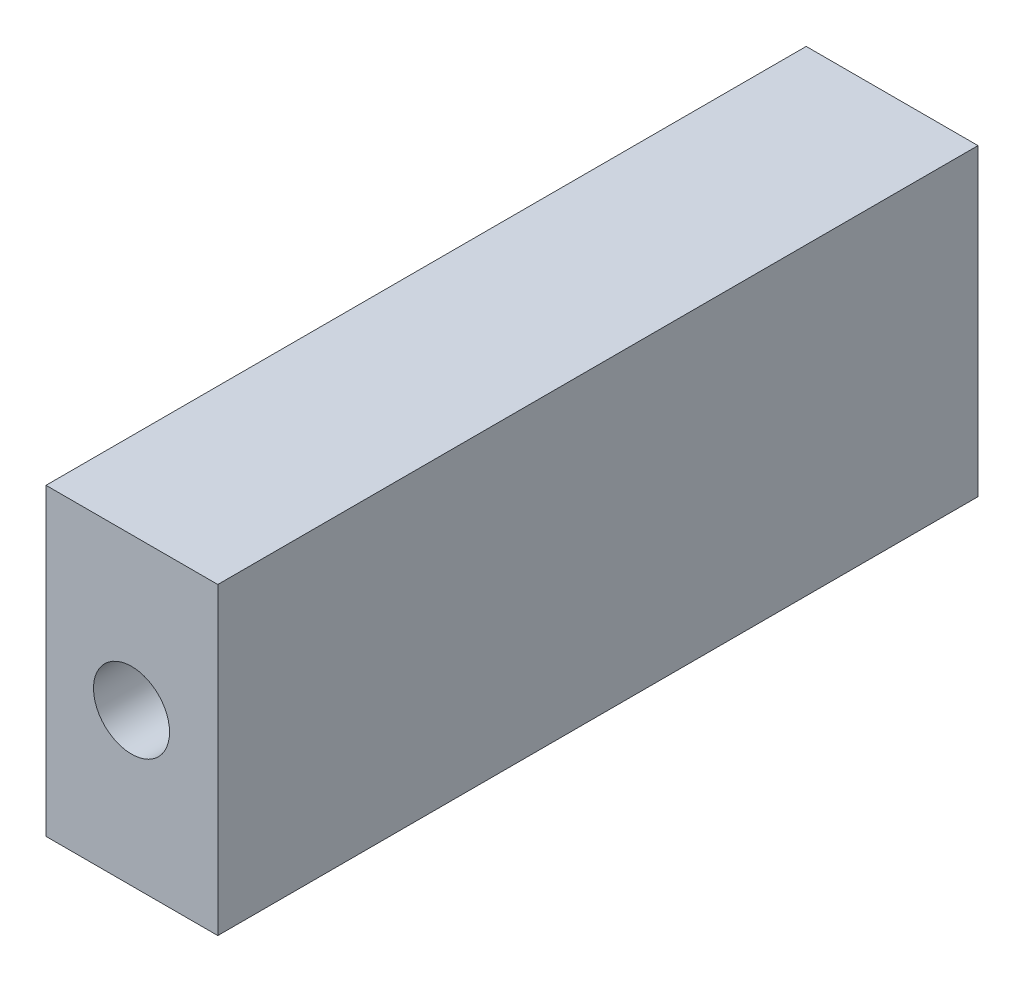
ISO-10303-21;
HEADER;
FILE_DESCRIPTION(('STEP AP214'),'2;1');
FILE_NAME('part.step','',(''),(''),'','','');
FILE_SCHEMA(('AUTOMOTIVE_DESIGN { 1 0 10303 214 1 1 1 1 }'));
ENDSEC;
DATA;
#1=APPLICATION_CONTEXT('core data for automotive mechanical design processes');
#2=APPLICATION_PROTOCOL_DEFINITION('international standard','automotive_design',2000,#1);
#3=PRODUCT_CONTEXT('',#1,'mechanical');
#4=PRODUCT('Part','Part','',(#3));
#5=PRODUCT_RELATED_PRODUCT_CATEGORY('part','',(#4));
#6=PRODUCT_DEFINITION_FORMATION('','',#4);
#7=PRODUCT_DEFINITION_CONTEXT('part definition',#1,'design');
#8=PRODUCT_DEFINITION('design','',#6,#7);
#9=PRODUCT_DEFINITION_SHAPE('','',#8);
#10=(LENGTH_UNIT() NAMED_UNIT(*) SI_UNIT(.MILLI.,.METRE.));
#11=(NAMED_UNIT(*) PLANE_ANGLE_UNIT() SI_UNIT($,.RADIAN.));
#12=(NAMED_UNIT(*) SI_UNIT($,.STERADIAN.) SOLID_ANGLE_UNIT());
#13=UNCERTAINTY_MEASURE_WITH_UNIT(LENGTH_MEASURE(1.E-05),#10,'distance_accuracy_value','');
#14=(GEOMETRIC_REPRESENTATION_CONTEXT(3) GLOBAL_UNCERTAINTY_ASSIGNED_CONTEXT((#13)) GLOBAL_UNIT_ASSIGNED_CONTEXT((#10,
#11,#12)) REPRESENTATION_CONTEXT('',''));
#15=CARTESIAN_POINT('',(0.,0.,0.));
#16=DIRECTION('',(0.,0.,1.));
#17=DIRECTION('',(1.,0.,0.));
#18=AXIS2_PLACEMENT_3D('',#15,#16,#17);
#19=CARTESIAN_POINT('',(0.,0.,10.));
#20=DIRECTION('',(1.,0.,0.));
#21=DIRECTION('',(0.,0.,-1.));
#22=AXIS2_PLACEMENT_3D('',#19,#20,#21);
#23=PLANE('',#22);
#24=DIRECTION('',(0.,-1.,0.));
#25=VECTOR('',#24,1.);
#26=CARTESIAN_POINT('',(0.,0.,0.));
#27=LINE('',#26,#25);
#28=CARTESIAN_POINT('',(0.,4.,0.));
#29=VERTEX_POINT('',#28);
#30=CARTESIAN_POINT('',(0.,0.,0.));
#31=VERTEX_POINT('',#30);
#32=EDGE_CURVE('E107',#29,#31,#27,.T.);
#33=ORIENTED_EDGE('',*,*,#32,.T.);
#34=DIRECTION('',(0.,0.,-1.));
#35=VECTOR('',#34,1.);
#36=CARTESIAN_POINT('',(0.,0.,10.));
#37=LINE('',#36,#35);
#38=CARTESIAN_POINT('',(0.,0.,10.));
#39=VERTEX_POINT('',#38);
#40=EDGE_CURVE('E11',#39,#31,#37,.T.);
#41=ORIENTED_EDGE('',*,*,#40,.F.);
#42=DIRECTION('',(0.,-1.,0.));
#43=VECTOR('',#42,1.);
#44=CARTESIAN_POINT('',(0.,0.,10.));
#45=LINE('',#44,#43);
#46=CARTESIAN_POINT('',(0.,4.,10.));
#47=VERTEX_POINT('',#46);
#48=EDGE_CURVE('E91',#47,#39,#45,.T.);
#49=ORIENTED_EDGE('',*,*,#48,.F.);
#50=DIRECTION('',(0.,0.,-1.));
#51=VECTOR('',#50,1.);
#52=CARTESIAN_POINT('',(0.,4.,10.));
#53=LINE('',#52,#51);
#54=EDGE_CURVE('E103',#47,#29,#53,.T.);
#55=ORIENTED_EDGE('',*,*,#54,.T.);
#56=EDGE_LOOP('',(#33,#41,#49,#55));
#57=FACE_BOUND('',#56,.T.);
#58=ADVANCED_FACE('F39',(#57),#23,.F.);
#59=CARTESIAN_POINT('',(0.,0.,10.));
#60=DIRECTION('',(0.,1.,0.));
#61=DIRECTION('',(0.,0.,1.));
#62=AXIS2_PLACEMENT_3D('',#59,#60,#61);
#63=PLANE('',#62);
#64=DIRECTION('',(1.,0.,0.));
#65=VECTOR('',#64,1.);
#66=CARTESIAN_POINT('',(0.,0.,0.));
#67=LINE('',#66,#65);
#68=CARTESIAN_POINT('',(2.26,0.,0.));
#69=VERTEX_POINT('',#68);
#70=EDGE_CURVE('E96',#31,#69,#67,.T.);
#71=ORIENTED_EDGE('',*,*,#70,.T.);
#72=DIRECTION('',(0.,0.,-1.));
#73=VECTOR('',#72,1.);
#74=CARTESIAN_POINT('',(2.26,0.,10.));
#75=LINE('',#74,#73);
#76=CARTESIAN_POINT('',(2.26,0.,10.));
#77=VERTEX_POINT('',#76);
#78=EDGE_CURVE('E48',#77,#69,#75,.T.);
#79=ORIENTED_EDGE('',*,*,#78,.F.);
#80=DIRECTION('',(1.,0.,0.));
#81=VECTOR('',#80,1.);
#82=CARTESIAN_POINT('',(0.,0.,10.));
#83=LINE('',#82,#81);
#84=EDGE_CURVE('E86',#39,#77,#83,.T.);
#85=ORIENTED_EDGE('',*,*,#84,.F.);
#86=ORIENTED_EDGE('',*,*,#40,.T.);
#87=EDGE_LOOP('',(#71,#79,#85,#86));
#88=FACE_BOUND('',#87,.T.);
#89=ADVANCED_FACE('F95',(#88),#63,.F.);
#90=CARTESIAN_POINT('',(2.26,0.,10.));
#91=DIRECTION('',(-1.,0.,0.));
#92=DIRECTION('',(0.,0.,1.));
#93=AXIS2_PLACEMENT_3D('',#90,#91,#92);
#94=PLANE('',#93);
#95=DIRECTION('',(0.,1.,0.));
#96=VECTOR('',#95,1.);
#97=CARTESIAN_POINT('',(2.26,0.,0.));
#98=LINE('',#97,#96);
#99=CARTESIAN_POINT('',(2.26,4.,0.));
#100=VERTEX_POINT('',#99);
#101=EDGE_CURVE('E73',#69,#100,#98,.T.);
#102=ORIENTED_EDGE('',*,*,#101,.T.);
#103=DIRECTION('',(0.,0.,-1.));
#104=VECTOR('',#103,1.);
#105=CARTESIAN_POINT('',(2.26,4.,10.));
#106=LINE('',#105,#104);
#107=CARTESIAN_POINT('',(2.26,4.,10.));
#108=VERTEX_POINT('',#107);
#109=EDGE_CURVE('E98',#108,#100,#106,.T.);
#110=ORIENTED_EDGE('',*,*,#109,.F.);
#111=DIRECTION('',(0.,1.,0.));
#112=VECTOR('',#111,1.);
#113=CARTESIAN_POINT('',(2.26,0.,10.));
#114=LINE('',#113,#112);
#115=EDGE_CURVE('E89',#77,#108,#114,.T.);
#116=ORIENTED_EDGE('',*,*,#115,.F.);
#117=ORIENTED_EDGE('',*,*,#78,.T.);
#118=EDGE_LOOP('',(#102,#110,#116,#117));
#119=FACE_BOUND('',#118,.T.);
#120=ADVANCED_FACE('F99',(#119),#94,.F.);
#121=CARTESIAN_POINT('',(0.,4.,10.));
#122=DIRECTION('',(0.,-1.,0.));
#123=DIRECTION('',(0.,0.,-1.));
#124=AXIS2_PLACEMENT_3D('',#121,#122,#123);
#125=PLANE('',#124);
#126=DIRECTION('',(-1.,0.,0.));
#127=VECTOR('',#126,1.);
#128=CARTESIAN_POINT('',(0.,4.,0.));
#129=LINE('',#128,#127);
#130=EDGE_CURVE('E79',#100,#29,#129,.T.);
#131=ORIENTED_EDGE('',*,*,#130,.T.);
#132=ORIENTED_EDGE('',*,*,#54,.F.);
#133=DIRECTION('',(-1.,0.,0.));
#134=VECTOR('',#133,1.);
#135=CARTESIAN_POINT('',(0.,4.,10.));
#136=LINE('',#135,#134);
#137=EDGE_CURVE('E56',#108,#47,#136,.T.);
#138=ORIENTED_EDGE('',*,*,#137,.F.);
#139=ORIENTED_EDGE('',*,*,#109,.T.);
#140=EDGE_LOOP('',(#131,#132,#138,#139));
#141=FACE_BOUND('',#140,.T.);
#142=ADVANCED_FACE('F121',(#141),#125,.F.);
#143=CARTESIAN_POINT('',(0.,0.,10.));
#144=DIRECTION('',(0.,0.,-1.));
#145=DIRECTION('',(-1.,0.,0.));
#146=AXIS2_PLACEMENT_3D('',#143,#144,#145);
#147=PLANE('',#146);
#148=CARTESIAN_POINT('',(1.125,2.,10.));
#149=DIRECTION('',(0.,0.,1.));
#150=DIRECTION('',(1.,0.,0.));
#151=AXIS2_PLACEMENT_3D('',#148,#149,#150);
#152=CIRCLE('',#151,0.5);
#153=CARTESIAN_POINT('',(1.625,2.,10.));
#154=VERTEX_POINT('',#153);
#155=EDGE_CURVE('E128',#154,#154,#152,.T.);
#156=ORIENTED_EDGE('',*,*,#155,.F.);
#157=EDGE_LOOP('',(#156));
#158=FACE_BOUND('',#157,.T.);
#159=ORIENTED_EDGE('',*,*,#48,.T.);
#160=ORIENTED_EDGE('',*,*,#84,.T.);
#161=ORIENTED_EDGE('',*,*,#115,.T.);
#162=ORIENTED_EDGE('',*,*,#137,.T.);
#163=EDGE_LOOP('',(#159,#160,#161,#162));
#164=FACE_BOUND('',#163,.T.);
#165=ADVANCED_FACE('F87',(#158,#164),#147,.F.);
#166=CARTESIAN_POINT('',(0.,0.,0.));
#167=DIRECTION('',(0.,0.,-1.));
#168=DIRECTION('',(-1.,0.,0.));
#169=AXIS2_PLACEMENT_3D('',#166,#167,#168);
#170=PLANE('',#169);
#171=ORIENTED_EDGE('',*,*,#32,.F.);
#172=ORIENTED_EDGE('',*,*,#130,.F.);
#173=ORIENTED_EDGE('',*,*,#101,.F.);
#174=ORIENTED_EDGE('',*,*,#70,.F.);
#175=EDGE_LOOP('',(#171,#172,#173,#174));
#176=FACE_BOUND('',#175,.T.);
#177=ADVANCED_FACE('F124',(#176),#170,.T.);
#178=CARTESIAN_POINT('',(1.125,2.,5.));
#179=DIRECTION('',(0.,0.,1.));
#180=DIRECTION('',(1.,0.,0.));
#181=AXIS2_PLACEMENT_3D('',#178,#179,#180);
#182=CYLINDRICAL_SURFACE('',#181,0.5);
#183=CARTESIAN_POINT('',(1.125,2.,5.));
#184=DIRECTION('',(0.,0.,1.));
#185=DIRECTION('',(1.,0.,0.));
#186=AXIS2_PLACEMENT_3D('',#183,#184,#185);
#187=CIRCLE('',#186,0.5);
#188=CARTESIAN_POINT('',(1.625,2.,5.));
#189=VERTEX_POINT('',#188);
#190=EDGE_CURVE('E111',#189,#189,#187,.T.);
#191=ORIENTED_EDGE('',*,*,#190,.F.);
#192=EDGE_LOOP('',(#191));
#193=FACE_BOUND('',#192,.T.);
#194=ORIENTED_EDGE('',*,*,#155,.T.);
#195=EDGE_LOOP('',(#194));
#196=FACE_BOUND('',#195,.T.);
#197=ADVANCED_FACE('F138',(#193,#196),#182,.F.);
#198=CARTESIAN_POINT('',(1.125,2.,5.));
#199=DIRECTION('',(0.,0.,1.));
#200=DIRECTION('',(1.,0.,0.));
#201=AXIS2_PLACEMENT_3D('',#198,#199,#200);
#202=PLANE('',#201);
#203=ORIENTED_EDGE('',*,*,#190,.T.);
#204=EDGE_LOOP('',(#203));
#205=FACE_BOUND('',#204,.T.);
#206=ADVANCED_FACE('F136',(#205),#202,.T.);
#207=CLOSED_SHELL('',(#58,#89,#120,#142,#165,#177,#197,#206));
#208=MANIFOLD_SOLID_BREP('B2',#207);
#209=ADVANCED_BREP_SHAPE_REPRESENTATION('',(#18,#208),#14);
#210=SHAPE_DEFINITION_REPRESENTATION(#9,#209);
ENDSEC;
END-ISO-10303-21;
